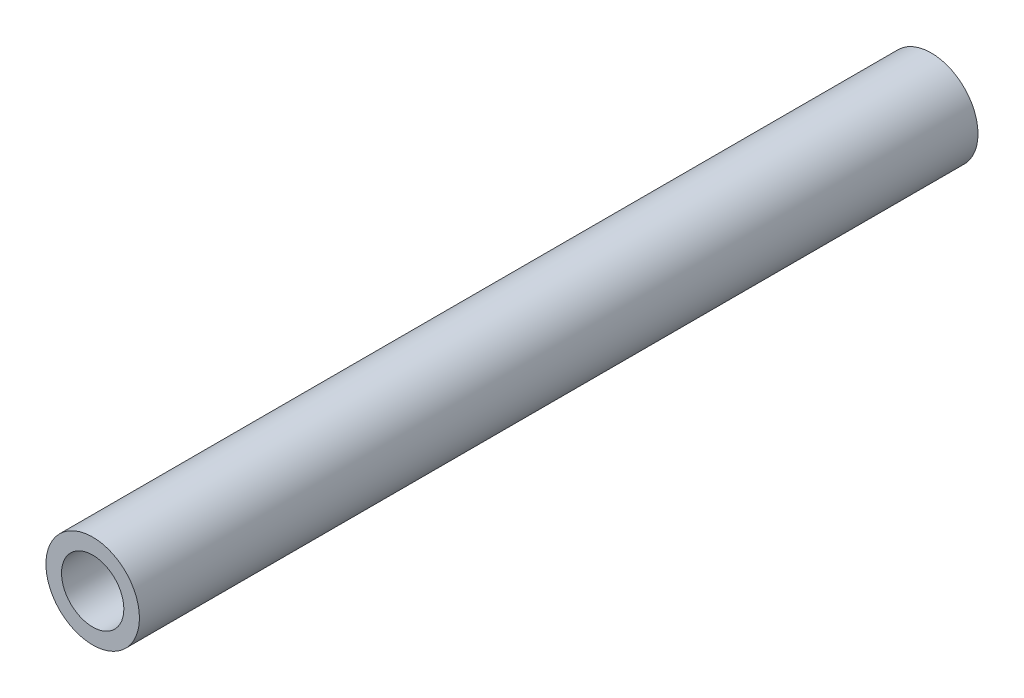
ISO-10303-21;
HEADER;
FILE_DESCRIPTION(('STEP AP214'),'2;1');
FILE_NAME('part.step','',(''),(''),'','','');
FILE_SCHEMA(('AUTOMOTIVE_DESIGN { 1 0 10303 214 1 1 1 1 }'));
ENDSEC;
DATA;
#1=APPLICATION_CONTEXT('core data for automotive mechanical design processes');
#2=APPLICATION_PROTOCOL_DEFINITION('international standard','automotive_design',2000,#1);
#3=PRODUCT_CONTEXT('',#1,'mechanical');
#4=PRODUCT('Part','Part','',(#3));
#5=PRODUCT_RELATED_PRODUCT_CATEGORY('part','',(#4));
#6=PRODUCT_DEFINITION_FORMATION('','',#4);
#7=PRODUCT_DEFINITION_CONTEXT('part definition',#1,'design');
#8=PRODUCT_DEFINITION('design','',#6,#7);
#9=PRODUCT_DEFINITION_SHAPE('','',#8);
#10=(LENGTH_UNIT() NAMED_UNIT(*) SI_UNIT(.MILLI.,.METRE.));
#11=(NAMED_UNIT(*) PLANE_ANGLE_UNIT() SI_UNIT($,.RADIAN.));
#12=(NAMED_UNIT(*) SI_UNIT($,.STERADIAN.) SOLID_ANGLE_UNIT());
#13=UNCERTAINTY_MEASURE_WITH_UNIT(LENGTH_MEASURE(1.E-05),#10,'distance_accuracy_value','');
#14=(GEOMETRIC_REPRESENTATION_CONTEXT(3) GLOBAL_UNCERTAINTY_ASSIGNED_CONTEXT((#13)) GLOBAL_UNIT_ASSIGNED_CONTEXT((#10,
#11,#12)) REPRESENTATION_CONTEXT('',''));
#15=CARTESIAN_POINT('',(0.,0.,0.));
#16=DIRECTION('',(0.,0.,1.));
#17=DIRECTION('',(1.,0.,0.));
#18=AXIS2_PLACEMENT_3D('',#15,#16,#17);
#19=CARTESIAN_POINT('',(0.,0.,136.652));
#20=DIRECTION('',(0.,0.,1.));
#21=DIRECTION('',(1.,0.,0.));
#22=AXIS2_PLACEMENT_3D('',#19,#20,#21);
#23=PLANE('',#22);
#24=CARTESIAN_POINT('',(0.,0.,136.652));
#25=DIRECTION('',(0.,0.,1.));
#26=DIRECTION('',(1.,0.,0.));
#27=AXIS2_PLACEMENT_3D('',#24,#25,#26);
#28=CIRCLE('',#27,7.62);
#29=CARTESIAN_POINT('',(7.62,0.,136.652));
#30=VERTEX_POINT('',#29);
#31=EDGE_CURVE('E10',#30,#30,#28,.T.);
#32=ORIENTED_EDGE('',*,*,#31,.T.);
#33=EDGE_LOOP('',(#32));
#34=FACE_BOUND('',#33,.T.);
#35=CARTESIAN_POINT('',(0.,0.,136.652));
#36=DIRECTION('',(0.,0.,1.));
#37=DIRECTION('',(1.,0.,0.));
#38=AXIS2_PLACEMENT_3D('',#35,#36,#37);
#39=CIRCLE('',#38,5.08);
#40=CARTESIAN_POINT('',(5.08,0.,136.652));
#41=VERTEX_POINT('',#40);
#42=EDGE_CURVE('E41',#41,#41,#39,.T.);
#43=ORIENTED_EDGE('',*,*,#42,.F.);
#44=EDGE_LOOP('',(#43));
#45=FACE_BOUND('',#44,.T.);
#46=ADVANCED_FACE('F30',(#34,#45),#23,.T.);
#47=CARTESIAN_POINT('',(0.,0.,0.));
#48=DIRECTION('',(0.,0.,1.));
#49=DIRECTION('',(1.,0.,0.));
#50=AXIS2_PLACEMENT_3D('',#47,#48,#49);
#51=PLANE('',#50);
#52=CARTESIAN_POINT('',(0.,0.,0.));
#53=DIRECTION('',(0.,0.,1.));
#54=DIRECTION('',(1.,0.,0.));
#55=AXIS2_PLACEMENT_3D('',#52,#53,#54);
#56=CIRCLE('',#55,7.62);
#57=CARTESIAN_POINT('',(7.62,0.,0.));
#58=VERTEX_POINT('',#57);
#59=EDGE_CURVE('E34',#58,#58,#56,.T.);
#60=ORIENTED_EDGE('',*,*,#59,.F.);
#61=EDGE_LOOP('',(#60));
#62=FACE_BOUND('',#61,.T.);
#63=CARTESIAN_POINT('',(0.,0.,0.));
#64=DIRECTION('',(0.,0.,1.));
#65=DIRECTION('',(1.,0.,0.));
#66=AXIS2_PLACEMENT_3D('',#63,#64,#65);
#67=CIRCLE('',#66,5.08);
#68=CARTESIAN_POINT('',(5.08,0.,0.));
#69=VERTEX_POINT('',#68);
#70=EDGE_CURVE('E43',#69,#69,#67,.T.);
#71=ORIENTED_EDGE('',*,*,#70,.T.);
#72=EDGE_LOOP('',(#71));
#73=FACE_BOUND('',#72,.T.);
#74=ADVANCED_FACE('F53',(#62,#73),#51,.F.);
#75=CARTESIAN_POINT('',(0.,0.,136.652));
#76=DIRECTION('',(0.,0.,-1.));
#77=DIRECTION('',(-1.,0.,0.));
#78=AXIS2_PLACEMENT_3D('',#75,#76,#77);
#79=CYLINDRICAL_SURFACE('',#78,7.62);
#80=ORIENTED_EDGE('',*,*,#31,.F.);
#81=EDGE_LOOP('',(#80));
#82=FACE_BOUND('',#81,.T.);
#83=ORIENTED_EDGE('',*,*,#59,.T.);
#84=EDGE_LOOP('',(#83));
#85=FACE_BOUND('',#84,.T.);
#86=ADVANCED_FACE('F32',(#82,#85),#79,.T.);
#87=CARTESIAN_POINT('',(0.,0.,136.652));
#88=DIRECTION('',(0.,0.,-1.));
#89=DIRECTION('',(-1.,0.,0.));
#90=AXIS2_PLACEMENT_3D('',#87,#88,#89);
#91=CYLINDRICAL_SURFACE('',#90,5.08);
#92=ORIENTED_EDGE('',*,*,#42,.T.);
#93=EDGE_LOOP('',(#92));
#94=FACE_BOUND('',#93,.T.);
#95=ORIENTED_EDGE('',*,*,#70,.F.);
#96=EDGE_LOOP('',(#95));
#97=FACE_BOUND('',#96,.T.);
#98=ADVANCED_FACE('F49',(#94,#97),#91,.F.);
#99=CLOSED_SHELL('',(#46,#74,#86,#98));
#100=MANIFOLD_SOLID_BREP('B2',#99);
#101=ADVANCED_BREP_SHAPE_REPRESENTATION('',(#18,#100),#14);
#102=SHAPE_DEFINITION_REPRESENTATION(#9,#101);
ENDSEC;
END-ISO-10303-21;
